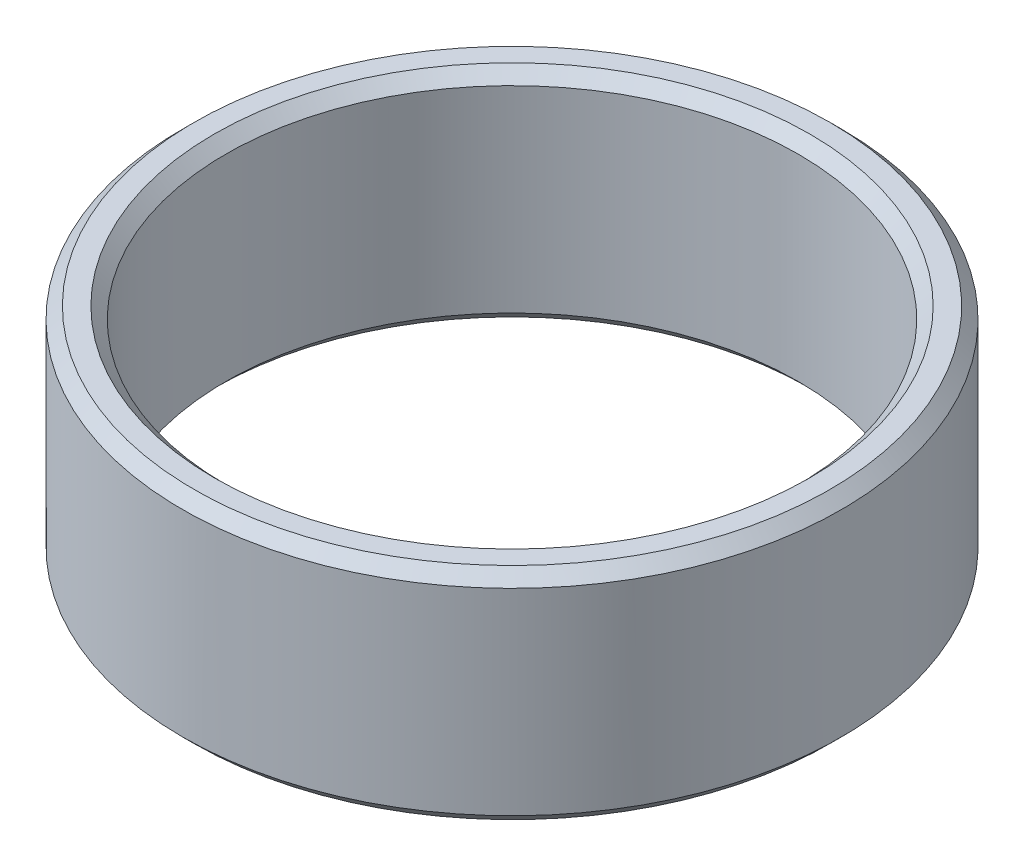
ISO-10303-21;
HEADER;
FILE_DESCRIPTION(('STEP AP214'),'2;1');
FILE_NAME('part.step','',(''),(''),'','','');
FILE_SCHEMA(('AUTOMOTIVE_DESIGN { 1 0 10303 214 1 1 1 1 }'));
ENDSEC;
DATA;
#1=APPLICATION_CONTEXT('core data for automotive mechanical design processes');
#2=APPLICATION_PROTOCOL_DEFINITION('international standard','automotive_design',2000,#1);
#3=PRODUCT_CONTEXT('',#1,'mechanical');
#4=PRODUCT('Part','Part','',(#3));
#5=PRODUCT_RELATED_PRODUCT_CATEGORY('part','',(#4));
#6=PRODUCT_DEFINITION_FORMATION('','',#4);
#7=PRODUCT_DEFINITION_CONTEXT('part definition',#1,'design');
#8=PRODUCT_DEFINITION('design','',#6,#7);
#9=PRODUCT_DEFINITION_SHAPE('','',#8);
#10=(LENGTH_UNIT() NAMED_UNIT(*) SI_UNIT(.MILLI.,.METRE.));
#11=(NAMED_UNIT(*) PLANE_ANGLE_UNIT() SI_UNIT($,.RADIAN.));
#12=(NAMED_UNIT(*) SI_UNIT($,.STERADIAN.) SOLID_ANGLE_UNIT());
#13=UNCERTAINTY_MEASURE_WITH_UNIT(LENGTH_MEASURE(1.E-05),#10,'distance_accuracy_value','');
#14=(GEOMETRIC_REPRESENTATION_CONTEXT(3) GLOBAL_UNCERTAINTY_ASSIGNED_CONTEXT((#13)) GLOBAL_UNIT_ASSIGNED_CONTEXT((#10,
#11,#12)) REPRESENTATION_CONTEXT('',''));
#15=CARTESIAN_POINT('',(0.,0.,0.));
#16=DIRECTION('',(0.,0.,1.));
#17=DIRECTION('',(1.,0.,0.));
#18=AXIS2_PLACEMENT_3D('',#15,#16,#17);
#19=CARTESIAN_POINT('',(0.,28.3841780625819,0.));
#20=DIRECTION('',(0.,-1.,0.));
#21=DIRECTION('',(0.,0.,-1.));
#22=AXIS2_PLACEMENT_3D('',#19,#20,#21);
#23=CYLINDRICAL_SURFACE('',#22,42.5);
#24=CARTESIAN_POINT('',(0.,1.49426471601902,0.));
#25=DIRECTION('',(0.,1.,0.));
#26=DIRECTION('',(0.,0.,1.));
#27=AXIS2_PLACEMENT_3D('',#24,#25,#26);
#28=CIRCLE('',#27,42.5);
#29=CARTESIAN_POINT('',(0.,1.49426471601902,-42.5));
#30=VERTEX_POINT('',#29);
#31=EDGE_CURVE('E10',#30,#30,#28,.T.);
#32=CARTESIAN_POINT('',(0.,26.8899133465629,0.));
#33=DIRECTION('',(0.,1.,0.));
#34=DIRECTION('',(0.,0.,1.));
#35=AXIS2_PLACEMENT_3D('',#32,#33,#34);
#36=CIRCLE('',#35,42.5);
#37=CARTESIAN_POINT('',(0.,26.8899133465629,-42.5));
#38=VERTEX_POINT('',#37);
#39=EDGE_CURVE('E50',#38,#38,#36,.F.);
#40=CARTESIAN_POINT('',(0.,1.49426471601902,-42.5));
#41=CARTESIAN_POINT('',(0.,1.75880272258719,-42.5));
#42=CARTESIAN_POINT('',(0.,2.02334072915535,-42.5));
#43=CARTESIAN_POINT('',(0.,2.55241674229168,-42.5));
#44=CARTESIAN_POINT('',(0.,2.81695474885985,-42.5));
#45=CARTESIAN_POINT('',(0.,3.34603076199618,-42.5));
#46=CARTESIAN_POINT('',(0.,3.61056876856434,-42.5));
#47=CARTESIAN_POINT('',(0.,4.13964478170068,-42.5));
#48=CARTESIAN_POINT('',(0.,4.40418278826884,-42.5));
#49=CARTESIAN_POINT('',(0.,4.93325880140517,-42.5));
#50=CARTESIAN_POINT('',(0.,5.19779680797334,-42.5));
#51=CARTESIAN_POINT('',(0.,5.72687282110967,-42.5));
#52=CARTESIAN_POINT('',(0.,5.99141082767783,-42.5));
#53=CARTESIAN_POINT('',(0.,6.52048684081417,-42.5));
#54=CARTESIAN_POINT('',(0.,6.78502484738233,-42.5));
#55=CARTESIAN_POINT('',(0.,7.31410086051866,-42.5));
#56=CARTESIAN_POINT('',(0.,7.57863886708683,-42.5));
#57=CARTESIAN_POINT('',(0.,8.10771488022316,-42.5));
#58=CARTESIAN_POINT('',(0.,8.37225288679133,-42.5));
#59=CARTESIAN_POINT('',(0.,8.90132889992766,-42.5));
#60=CARTESIAN_POINT('',(0.,9.16586690649582,-42.5));
#61=CARTESIAN_POINT('',(0.,9.69494291963215,-42.5));
#62=CARTESIAN_POINT('',(0.,9.95948092620032,-42.5));
#63=CARTESIAN_POINT('',(0.,10.4885569393367,-42.5));
#64=CARTESIAN_POINT('',(0.,10.7530949459048,-42.5));
#65=CARTESIAN_POINT('',(0.,11.2821709590411,-42.5));
#66=CARTESIAN_POINT('',(0.,11.5467089656093,-42.5));
#67=CARTESIAN_POINT('',(0.,12.0757849787456,-42.5));
#68=CARTESIAN_POINT('',(0.,12.3403229853138,-42.5));
#69=CARTESIAN_POINT('',(0.,12.8693989984501,-42.5));
#70=CARTESIAN_POINT('',(0.,13.1339370050183,-42.5));
#71=CARTESIAN_POINT('',(0.,13.6630130181546,-42.5));
#72=CARTESIAN_POINT('',(0.,13.9275510247228,-42.5));
#73=CARTESIAN_POINT('',(0.,14.4566270378591,-42.5));
#74=CARTESIAN_POINT('',(0.,14.7211650444273,-42.5));
#75=CARTESIAN_POINT('',(0.,15.2502410575636,-42.5));
#76=CARTESIAN_POINT('',(0.,15.5147790641318,-42.5));
#77=CARTESIAN_POINT('',(0.,16.0438550772681,-42.5));
#78=CARTESIAN_POINT('',(0.,16.3083930838363,-42.5));
#79=CARTESIAN_POINT('',(0.,16.8374690969726,-42.5));
#80=CARTESIAN_POINT('',(0.,17.1020071035408,-42.5));
#81=CARTESIAN_POINT('',(0.,17.6310831166771,-42.5));
#82=CARTESIAN_POINT('',(0.,17.8956211232453,-42.5));
#83=CARTESIAN_POINT('',(0.,18.4246971363816,-42.5));
#84=CARTESIAN_POINT('',(0.,18.6892351429498,-42.5));
#85=CARTESIAN_POINT('',(0.,19.2183111560861,-42.5));
#86=CARTESIAN_POINT('',(0.,19.4828491626543,-42.5));
#87=CARTESIAN_POINT('',(0.,20.0119251757906,-42.5));
#88=CARTESIAN_POINT('',(0.,20.2764631823588,-42.5));
#89=CARTESIAN_POINT('',(0.,20.8055391954951,-42.5));
#90=CARTESIAN_POINT('',(0.,21.0700772020633,-42.5));
#91=CARTESIAN_POINT('',(0.,21.5991532151996,-42.5));
#92=CARTESIAN_POINT('',(0.,21.8636912217678,-42.5));
#93=CARTESIAN_POINT('',(0.,22.3927672349041,-42.5));
#94=CARTESIAN_POINT('',(0.,22.6573052414723,-42.5));
#95=CARTESIAN_POINT('',(0.,23.1863812546086,-42.5));
#96=CARTESIAN_POINT('',(0.,23.4509192611768,-42.5));
#97=CARTESIAN_POINT('',(0.,23.9799952743131,-42.5));
#98=CARTESIAN_POINT('',(0.,24.2445332808813,-42.5));
#99=CARTESIAN_POINT('',(0.,24.7736092940176,-42.5));
#100=CARTESIAN_POINT('',(0.,25.0381473005858,-42.5));
#101=CARTESIAN_POINT('',(0.,25.5672233137221,-42.5));
#102=CARTESIAN_POINT('',(0.,25.8317613202903,-42.5));
#103=CARTESIAN_POINT('',(0.,26.3608373334266,-42.5));
#104=CARTESIAN_POINT('',(0.,26.6253753399948,-42.5));
#105=CARTESIAN_POINT('',(0.,26.8899133465629,-42.5));
#106=B_SPLINE_CURVE_WITH_KNOTS('',3,(#40,#41,#42,#43,#44,#45,#46,#47,#48,#49,#50,#51,#52,#53,
#54,#55,#56,#57,#58,#59,#60,#61,#62,#63,#64,#65,#66,#67,#68,#69,#70,#71,#72,#73,#74,#75,#76,#77,
#78,#79,#80,#81,#82,#83,#84,#85,#86,#87,#88,#89,#90,#91,#92,#93,#94,#95,#96,#97,#98,#99,#100,
#101,#102,#103,#104,#105),.UNSPECIFIED.,.F.,.F.,(4,2,2,2,2,2,2,2,2,2,2,2,2,2,2,2,2,2,2,2,2,2,2,
2,2,2,2,2,2,2,2,2,4),(0.,0.793614019704497,1.58722803940899,2.38084205911349,3.17445607881799,
3.96807009852248,4.76168411822698,5.55529813793148,6.34891215763597,7.14252617734047,
7.93614019704497,8.72975421674946,9.52336823645396,10.3169822561585,11.110596275863,
11.9042102955675,12.6978243152719,13.4914383349764,14.2850523546809,15.0786663743854,
15.8722803940899,16.6658944137944,17.4595084334989,18.2531224532034,19.0467364729079,
19.8403504926124,20.6339645123169,21.4275785320214,22.2211925517259,23.0148065714304,
23.8084205911349,24.6020346108394,25.3956486305439),.UNSPECIFIED.);
#107=EDGE_CURVE('BSEAM39',#30,#38,#106,.T.);
#108=ORIENTED_EDGE('',*,*,#31,.T.);
#109=ORIENTED_EDGE('',*,*,#39,.T.);
#110=ORIENTED_EDGE('',*,*,#107,.T.);
#111=ORIENTED_EDGE('',*,*,#107,.F.);
#112=EDGE_LOOP('',(#108,#110,#109,#111));
#113=FACE_BOUND('',#112,.T.);
#114=ADVANCED_FACE('F39',(#113),#23,.T.);
#115=CARTESIAN_POINT('',(0.,28.3841780625819,0.));
#116=DIRECTION('',(0.,1.,0.));
#117=DIRECTION('',(0.,0.,1.));
#118=AXIS2_PLACEMENT_3D('',#115,#116,#117);
#119=PLANE('',#118);
#120=CARTESIAN_POINT('',(0.,28.3841780625819,0.));
#121=DIRECTION('',(0.,1.,0.));
#122=DIRECTION('',(0.,0.,1.));
#123=AXIS2_PLACEMENT_3D('',#120,#121,#122);
#124=CIRCLE('',#123,38.4071790146563);
#125=CARTESIAN_POINT('',(0.,28.3841780625819,38.4071790146563));
#126=VERTEX_POINT('',#125);
#127=EDGE_CURVE('E58',#126,#126,#124,.F.);
#128=ORIENTED_EDGE('',*,*,#127,.T.);
#129=EDGE_LOOP('',(#128));
#130=FACE_BOUND('',#129,.T.);
#131=CARTESIAN_POINT('',(0.,28.3841780625819,0.));
#132=DIRECTION('',(0.,1.,0.));
#133=DIRECTION('',(0.,0.,1.));
#134=AXIS2_PLACEMENT_3D('',#131,#132,#133);
#135=CIRCLE('',#134,41.005735283981);
#136=CARTESIAN_POINT('',(0.,28.3841780625819,-41.005735283981));
#137=VERTEX_POINT('',#136);
#138=EDGE_CURVE('E61',#137,#137,#135,.T.);
#139=ORIENTED_EDGE('',*,*,#138,.T.);
#140=EDGE_LOOP('',(#139));
#141=FACE_BOUND('',#140,.T.);
#142=ADVANCED_FACE('F88',(#130,#141),#119,.T.);
#143=CARTESIAN_POINT('',(0.,0.,0.));
#144=DIRECTION('',(0.,1.,0.));
#145=DIRECTION('',(0.,0.,1.));
#146=AXIS2_PLACEMENT_3D('',#143,#144,#145);
#147=PLANE('',#146);
#148=CARTESIAN_POINT('',(0.,0.,0.));
#149=DIRECTION('',(0.,1.,0.));
#150=DIRECTION('',(0.,0.,1.));
#151=AXIS2_PLACEMENT_3D('',#148,#149,#150);
#152=CIRCLE('',#151,38.4071790146564);
#153=CARTESIAN_POINT('',(0.,0.,38.4071790146564));
#154=VERTEX_POINT('',#153);
#155=EDGE_CURVE('E51',#154,#154,#152,.T.);
#156=ORIENTED_EDGE('',*,*,#155,.T.);
#157=EDGE_LOOP('',(#156));
#158=FACE_BOUND('',#157,.T.);
#159=CARTESIAN_POINT('',(0.,0.,0.));
#160=DIRECTION('',(0.,1.,0.));
#161=DIRECTION('',(0.,0.,1.));
#162=AXIS2_PLACEMENT_3D('',#159,#160,#161);
#163=CIRCLE('',#162,41.005735283981);
#164=CARTESIAN_POINT('',(0.,0.,41.005735283981));
#165=VERTEX_POINT('',#164);
#166=EDGE_CURVE('E54',#165,#165,#163,.F.);
#167=ORIENTED_EDGE('',*,*,#166,.T.);
#168=EDGE_LOOP('',(#167));
#169=FACE_BOUND('',#168,.T.);
#170=ADVANCED_FACE('F83',(#158,#169),#147,.F.);
#171=CARTESIAN_POINT('',(0.,28.3841780625819,0.));
#172=DIRECTION('',(0.,-1.,0.));
#173=DIRECTION('',(0.,0.,-1.));
#174=AXIS2_PLACEMENT_3D('',#171,#172,#173);
#175=CYLINDRICAL_SURFACE('',#174,36.9129142986373);
#176=CARTESIAN_POINT('',(0.,26.8899133465629,0.));
#177=DIRECTION('',(0.,1.,0.));
#178=DIRECTION('',(0.,0.,1.));
#179=AXIS2_PLACEMENT_3D('',#176,#177,#178);
#180=CIRCLE('',#179,36.9129142986373);
#181=CARTESIAN_POINT('',(0.,26.8899133465629,36.9129142986373));
#182=VERTEX_POINT('',#181);
#183=EDGE_CURVE('E67',#182,#182,#180,.T.);
#184=ORIENTED_EDGE('',*,*,#183,.T.);
#185=EDGE_LOOP('',(#184));
#186=FACE_BOUND('',#185,.T.);
#187=CARTESIAN_POINT('',(0.,1.49426471601905,0.));
#188=DIRECTION('',(0.,1.,0.));
#189=DIRECTION('',(0.,0.,1.));
#190=AXIS2_PLACEMENT_3D('',#187,#188,#189);
#191=CIRCLE('',#190,36.9129142986373);
#192=CARTESIAN_POINT('',(0.,1.49426471601905,36.9129142986373));
#193=VERTEX_POINT('',#192);
#194=EDGE_CURVE('E69',#193,#193,#191,.F.);
#195=ORIENTED_EDGE('',*,*,#194,.T.);
#196=EDGE_LOOP('',(#195));
#197=FACE_BOUND('',#196,.T.);
#198=ADVANCED_FACE('F71',(#186,#197),#175,.F.);
#199=CARTESIAN_POINT('',(0.,26.8899133465629,0.));
#200=DIRECTION('',(0.,1.,0.));
#201=DIRECTION('',(0.,0.,1.));
#202=AXIS2_PLACEMENT_3D('',#199,#200,#201);
#203=CONICAL_SURFACE('',#202,36.9129142986373,0.785398163397453);
#204=CARTESIAN_POINT('',(0.,28.3841780625819,38.4071790146563));
#205=CARTESIAN_POINT('',(0.,28.3686128051234,38.3916137571978));
#206=CARTESIAN_POINT('',(0.,28.3530475476649,38.3760484997393));
#207=CARTESIAN_POINT('',(0.,28.3219170327478,38.3449179848222));
#208=CARTESIAN_POINT('',(0.,28.3063517752893,38.3293527273637));
#209=CARTESIAN_POINT('',(0.,28.2752212603722,38.2982222124466));
#210=CARTESIAN_POINT('',(0.,28.2596560029137,38.2826569549881));
#211=CARTESIAN_POINT('',(0.,28.2285254879966,38.251526440071));
#212=CARTESIAN_POINT('',(0.,28.2129602305381,38.2359611826125));
#213=CARTESIAN_POINT('',(0.,28.181829715621,38.2048306676954));
#214=CARTESIAN_POINT('',(0.,28.1662644581625,38.1892654102369));
#215=CARTESIAN_POINT('',(0.,28.1351339432454,38.1581348953198));
#216=CARTESIAN_POINT('',(0.,28.1195686857869,38.1425696378613));
#217=CARTESIAN_POINT('',(0.,28.0884381708698,38.1114391229442));
#218=CARTESIAN_POINT('',(0.,28.0728729134113,38.0958738654857));
#219=CARTESIAN_POINT('',(0.,28.0417423984942,38.0647433505686));
#220=CARTESIAN_POINT('',(0.,28.0261771410357,38.0491780931101));
#221=CARTESIAN_POINT('',(0.,27.9950466261187,38.0180475781931));
#222=CARTESIAN_POINT('',(0.,27.9794813686601,38.0024823207345));
#223=CARTESIAN_POINT('',(0.,27.9483508537431,37.9713518058175));
#224=CARTESIAN_POINT('',(0.,27.9327855962845,37.9557865483589));
#225=CARTESIAN_POINT('',(0.,27.9016550813675,37.9246560334419));
#226=CARTESIAN_POINT('',(0.,27.8860898239089,37.9090907759833));
#227=CARTESIAN_POINT('',(0.,27.8549593089919,37.8779602610663));
#228=CARTESIAN_POINT('',(0.,27.8393940515333,37.8623950036077));
#229=CARTESIAN_POINT('',(0.,27.8082635366163,37.8312644886907));
#230=CARTESIAN_POINT('',(0.,27.7926982791577,37.8156992312321));
#231=CARTESIAN_POINT('',(0.,27.7615677642407,37.7845687163151));
#232=CARTESIAN_POINT('',(0.,27.7460025067821,37.7690034588565));
#233=CARTESIAN_POINT('',(0.,27.7148719918651,37.7378729439395));
#234=CARTESIAN_POINT('',(0.,27.6993067344066,37.722307686481));
#235=CARTESIAN_POINT('',(0.,27.6681762194895,37.6911771715639));
#236=CARTESIAN_POINT('',(0.,27.652610962031,37.6756119141054));
#237=CARTESIAN_POINT('',(0.,27.6214804471139,37.6444813991883));
#238=CARTESIAN_POINT('',(0.,27.6059151896554,37.6289161417298));
#239=CARTESIAN_POINT('',(0.,27.5747846747383,37.5977856268127));
#240=CARTESIAN_POINT('',(0.,27.5592194172798,37.5822203693542));
#241=CARTESIAN_POINT('',(0.,27.5280889023627,37.5510898544371));
#242=CARTESIAN_POINT('',(0.,27.5125236449042,37.5355245969786));
#243=CARTESIAN_POINT('',(0.,27.4813931299871,37.5043940820615));
#244=CARTESIAN_POINT('',(0.,27.4658278725286,37.488828824603));
#245=CARTESIAN_POINT('',(0.,27.4346973576115,37.4576983096859));
#246=CARTESIAN_POINT('',(0.,27.419132100153,37.4421330522274));
#247=CARTESIAN_POINT('',(0.,27.3880015852359,37.4110025373103));
#248=CARTESIAN_POINT('',(0.,27.3724363277774,37.3954372798518));
#249=CARTESIAN_POINT('',(0.,27.3413058128603,37.3643067649347));
#250=CARTESIAN_POINT('',(0.,27.3257405554018,37.3487415074762));
#251=CARTESIAN_POINT('',(0.,27.2946100404847,37.3176109925591));
#252=CARTESIAN_POINT('',(0.,27.2790447830262,37.3020457351006));
#253=CARTESIAN_POINT('',(0.,27.2479142681091,37.2709152201835));
#254=CARTESIAN_POINT('',(0.,27.2323490106506,37.255349962725));
#255=CARTESIAN_POINT('',(0.,27.2012184957335,37.2242194478079));
#256=CARTESIAN_POINT('',(0.,27.185653238275,37.2086541903494));
#257=CARTESIAN_POINT('',(0.,27.1545227233579,37.1775236754323));
#258=CARTESIAN_POINT('',(0.,27.1389574658994,37.1619584179738));
#259=CARTESIAN_POINT('',(0.,27.1078269509824,37.1308279030568));
#260=CARTESIAN_POINT('',(0.,27.0922616935238,37.1152626455982));
#261=CARTESIAN_POINT('',(0.,27.0611311786068,37.0841321306812));
#262=CARTESIAN_POINT('',(0.,27.0455659211482,37.0685668732226));
#263=CARTESIAN_POINT('',(0.,27.0144354062312,37.0374363583056));
#264=CARTESIAN_POINT('',(0.,26.9988701487726,37.021871100847));
#265=CARTESIAN_POINT('',(0.,26.9677396338556,36.99074058593));
#266=CARTESIAN_POINT('',(0.,26.952174376397,36.9751753284714));
#267=CARTESIAN_POINT('',(0.,26.92104386148,36.9440448135544));
#268=CARTESIAN_POINT('',(0.,26.9054786040214,36.9284795560958));
#269=CARTESIAN_POINT('',(0.,26.8899133465629,36.9129142986373));
#270=B_SPLINE_CURVE_WITH_KNOTS('',3,(#204,#205,#206,#207,#208,#209,#210,#211,#212,#213,#214,
#215,#216,#217,#218,#219,#220,#221,#222,#223,#224,#225,#226,#227,#228,#229,#230,#231,#232,#233,
#234,#235,#236,#237,#238,#239,#240,#241,#242,#243,#244,#245,#246,#247,#248,#249,#250,#251,#252,
#253,#254,#255,#256,#257,#258,#259,#260,#261,#262,#263,#264,#265,#266,#267,#268,#269),
.UNSPECIFIED.,.F.,.F.,(4,2,2,2,2,2,2,2,2,2,2,2,2,2,2,2,2,2,2,2,2,2,2,2,2,2,2,2,2,2,2,2,4),(0.,
0.0660377945990536,0.13207558919811,0.198113383797161,0.264151178396214,0.330188972995265,
0.396226767594322,0.462264562193375,0.528302356792426,0.594340151391477,0.660377945990531,
0.726415740589587,0.792453535188638,0.858491329787692,0.924529124386743,0.990566918985799,
1.05660471358485,1.1226425081839,1.18868030278295,1.25471809738201,1.32075589198106,
1.38679368658012,1.45283148117917,1.51886927577822,1.58490707037728,1.65094486497633,
1.71698265957538,1.78302045417443,1.84905824877348,1.91509604337254,1.98113383797159,
2.04717163257064,2.1132094271697),.UNSPECIFIED.);
#271=EDGE_CURVE('BSEAM77',#126,#182,#270,.T.);
#272=ORIENTED_EDGE('',*,*,#127,.F.);
#273=ORIENTED_EDGE('',*,*,#183,.F.);
#274=ORIENTED_EDGE('',*,*,#271,.T.);
#275=ORIENTED_EDGE('',*,*,#271,.F.);
#276=EDGE_LOOP('',(#272,#274,#273,#275));
#277=FACE_BOUND('',#276,.T.);
#278=ADVANCED_FACE('F77',(#277),#203,.F.);
#279=CARTESIAN_POINT('',(0.,0.,0.));
#280=DIRECTION('',(0.,-1.,0.));
#281=DIRECTION('',(0.,0.,-1.));
#282=AXIS2_PLACEMENT_3D('',#279,#280,#281);
#283=CONICAL_SURFACE('',#282,38.4071790146564,0.785398163397446);
#284=ORIENTED_EDGE('',*,*,#194,.F.);
#285=EDGE_LOOP('',(#284));
#286=FACE_BOUND('',#285,.T.);
#287=ORIENTED_EDGE('',*,*,#155,.F.);
#288=EDGE_LOOP('',(#287));
#289=FACE_BOUND('',#288,.T.);
#290=ADVANCED_FACE('F73',(#286,#289),#283,.F.);
#291=CARTESIAN_POINT('',(0.,1.49426471601902,0.));
#292=DIRECTION('',(0.,1.,0.));
#293=DIRECTION('',(0.,0.,1.));
#294=AXIS2_PLACEMENT_3D('',#291,#292,#293);
#295=CONICAL_SURFACE('',#294,42.5,0.785398163397448);
#296=ORIENTED_EDGE('',*,*,#166,.F.);
#297=EDGE_LOOP('',(#296));
#298=FACE_BOUND('',#297,.T.);
#299=ORIENTED_EDGE('',*,*,#31,.F.);
#300=EDGE_LOOP('',(#299));
#301=FACE_BOUND('',#300,.T.);
#302=ADVANCED_FACE('F76',(#298,#301),#295,.T.);
#303=CARTESIAN_POINT('',(0.,28.3841780625819,0.));
#304=DIRECTION('',(0.,-1.,0.));
#305=DIRECTION('',(0.,0.,-1.));
#306=AXIS2_PLACEMENT_3D('',#303,#304,#305);
#307=CONICAL_SURFACE('',#306,41.005735283981,0.785398163397446);
#308=CARTESIAN_POINT('',(0.,26.8899133465629,-42.5));
#309=CARTESIAN_POINT('',(0.,26.9054786040214,-42.4844347425415));
#310=CARTESIAN_POINT('',(0.,26.92104386148,-42.4688694850829));
#311=CARTESIAN_POINT('',(0.,26.952174376397,-42.4377389701659));
#312=CARTESIAN_POINT('',(0.,26.9677396338556,-42.4221737127074));
#313=CARTESIAN_POINT('',(0.,26.9988701487726,-42.3910431977903));
#314=CARTESIAN_POINT('',(0.,27.0144354062312,-42.3754779403318));
#315=CARTESIAN_POINT('',(0.,27.0455659211482,-42.3443474254147));
#316=CARTESIAN_POINT('',(0.,27.0611311786068,-42.3287821679562));
#317=CARTESIAN_POINT('',(0.,27.0922616935238,-42.2976516530391));
#318=CARTESIAN_POINT('',(0.,27.1078269509824,-42.2820863955806));
#319=CARTESIAN_POINT('',(0.,27.1389574658994,-42.2509558806635));
#320=CARTESIAN_POINT('',(0.,27.1545227233579,-42.235390623205));
#321=CARTESIAN_POINT('',(0.,27.185653238275,-42.2042601082879));
#322=CARTESIAN_POINT('',(0.,27.2012184957335,-42.1886948508294));
#323=CARTESIAN_POINT('',(0.,27.2323490106506,-42.1575643359123));
#324=CARTESIAN_POINT('',(0.,27.2479142681091,-42.1419990784538));
#325=CARTESIAN_POINT('',(0.,27.2790447830262,-42.1108685635367));
#326=CARTESIAN_POINT('',(0.,27.2946100404847,-42.0953033060782));
#327=CARTESIAN_POINT('',(0.,27.3257405554018,-42.0641727911611));
#328=CARTESIAN_POINT('',(0.,27.3413058128603,-42.0486075337026));
#329=CARTESIAN_POINT('',(0.,27.3724363277774,-42.0174770187855));
#330=CARTESIAN_POINT('',(0.,27.3880015852359,-42.001911761327));
#331=CARTESIAN_POINT('',(0.,27.419132100153,-41.9707812464099));
#332=CARTESIAN_POINT('',(0.,27.4346973576115,-41.9552159889514));
#333=CARTESIAN_POINT('',(0.,27.4658278725286,-41.9240854740344));
#334=CARTESIAN_POINT('',(0.,27.4813931299871,-41.9085202165758));
#335=CARTESIAN_POINT('',(0.,27.5125236449042,-41.8773897016587));
#336=CARTESIAN_POINT('',(0.,27.5280889023627,-41.8618244442002));
#337=CARTESIAN_POINT('',(0.,27.5592194172798,-41.8306939292832));
#338=CARTESIAN_POINT('',(0.,27.5747846747383,-41.8151286718246));
#339=CARTESIAN_POINT('',(0.,27.6059151896554,-41.7839981569076));
#340=CARTESIAN_POINT('',(0.,27.6214804471139,-41.768432899449));
#341=CARTESIAN_POINT('',(0.,27.652610962031,-41.737302384532));
#342=CARTESIAN_POINT('',(0.,27.6681762194895,-41.7217371270734));
#343=CARTESIAN_POINT('',(0.,27.6993067344066,-41.6906066121564));
#344=CARTESIAN_POINT('',(0.,27.7148719918651,-41.6750413546978));
#345=CARTESIAN_POINT('',(0.,27.7460025067821,-41.6439108397808));
#346=CARTESIAN_POINT('',(0.,27.7615677642407,-41.6283455823222));
#347=CARTESIAN_POINT('',(0.,27.7926982791577,-41.5972150674052));
#348=CARTESIAN_POINT('',(0.,27.8082635366163,-41.5816498099467));
#349=CARTESIAN_POINT('',(0.,27.8393940515333,-41.5505192950296));
#350=CARTESIAN_POINT('',(0.,27.8549593089919,-41.5349540375711));
#351=CARTESIAN_POINT('',(0.,27.8860898239089,-41.503823522654));
#352=CARTESIAN_POINT('',(0.,27.9016550813675,-41.4882582651955));
#353=CARTESIAN_POINT('',(0.,27.9327855962845,-41.4571277502784));
#354=CARTESIAN_POINT('',(0.,27.9483508537431,-41.4415624928199));
#355=CARTESIAN_POINT('',(0.,27.9794813686601,-41.4104319779028));
#356=CARTESIAN_POINT('',(0.,27.9950466261187,-41.3948667204443));
#357=CARTESIAN_POINT('',(0.,28.0261771410357,-41.3637362055272));
#358=CARTESIAN_POINT('',(0.,28.0417423984942,-41.3481709480687));
#359=CARTESIAN_POINT('',(0.,28.0728729134113,-41.3170404331516));
#360=CARTESIAN_POINT('',(0.,28.0884381708698,-41.3014751756931));
#361=CARTESIAN_POINT('',(0.,28.1195686857869,-41.270344660776));
#362=CARTESIAN_POINT('',(0.,28.1351339432454,-41.2547794033175));
#363=CARTESIAN_POINT('',(0.,28.1662644581625,-41.2236488884004));
#364=CARTESIAN_POINT('',(0.,28.181829715621,-41.2080836309419));
#365=CARTESIAN_POINT('',(0.,28.2129602305381,-41.1769531160248));
#366=CARTESIAN_POINT('',(0.,28.2285254879966,-41.1613878585663));
#367=CARTESIAN_POINT('',(0.,28.2596560029137,-41.1302573436492));
#368=CARTESIAN_POINT('',(0.,28.2752212603722,-41.1146920861907));
#369=CARTESIAN_POINT('',(0.,28.3063517752893,-41.0835615712736));
#370=CARTESIAN_POINT('',(0.,28.3219170327478,-41.0679963138151));
#371=CARTESIAN_POINT('',(0.,28.3530475476649,-41.0368657988981));
#372=CARTESIAN_POINT('',(0.,28.3686128051234,-41.0213005414395));
#373=CARTESIAN_POINT('',(0.,28.3841780625819,-41.005735283981));
#374=B_SPLINE_CURVE_WITH_KNOTS('',3,(#308,#309,#310,#311,#312,#313,#314,#315,#316,#317,#318,
#319,#320,#321,#322,#323,#324,#325,#326,#327,#328,#329,#330,#331,#332,#333,#334,#335,#336,#337,
#338,#339,#340,#341,#342,#343,#344,#345,#346,#347,#348,#349,#350,#351,#352,#353,#354,#355,#356,
#357,#358,#359,#360,#361,#362,#363,#364,#365,#366,#367,#368,#369,#370,#371,#372,#373),
.UNSPECIFIED.,.F.,.F.,(4,2,2,2,2,2,2,2,2,2,2,2,2,2,2,2,2,2,2,2,2,2,2,2,2,2,2,2,2,2,2,2,4),(0.,
0.0660377945990511,0.132075589198102,0.198113383797156,0.264151178396207,0.330188972995258,
0.396226767594309,0.462264562193368,0.528302356792419,0.59434015139147,0.660377945990523,
0.726415740589575,0.792453535188626,0.858491329787679,0.924529124386736,0.990566918985787,
1.05660471358484,1.12264250818389,1.18868030278294,1.25471809738199,1.32075589198105,
1.3867936865801,1.45283148117915,1.51886927577821,1.58490707037726,1.65094486497631,
1.71698265957536,1.78302045417442,1.84905824877347,1.91509604337252,1.98113383797158,
2.04717163257063,2.11320942716968),.UNSPECIFIED.);
#375=EDGE_CURVE('BSEAM45',#38,#137,#374,.T.);
#376=ORIENTED_EDGE('',*,*,#39,.F.);
#377=ORIENTED_EDGE('',*,*,#138,.F.);
#378=ORIENTED_EDGE('',*,*,#375,.T.);
#379=ORIENTED_EDGE('',*,*,#375,.F.);
#380=EDGE_LOOP('',(#376,#378,#377,#379));
#381=FACE_BOUND('',#380,.T.);
#382=ADVANCED_FACE('F45',(#381),#307,.T.);
#383=CLOSED_SHELL('',(#114,#142,#170,#198,#278,#290,#302,#382));
#384=MANIFOLD_SOLID_BREP('B2',#383);
#385=ADVANCED_BREP_SHAPE_REPRESENTATION('',(#18,#384),#14);
#386=SHAPE_DEFINITION_REPRESENTATION(#9,#385);
ENDSEC;
END-ISO-10303-21;
